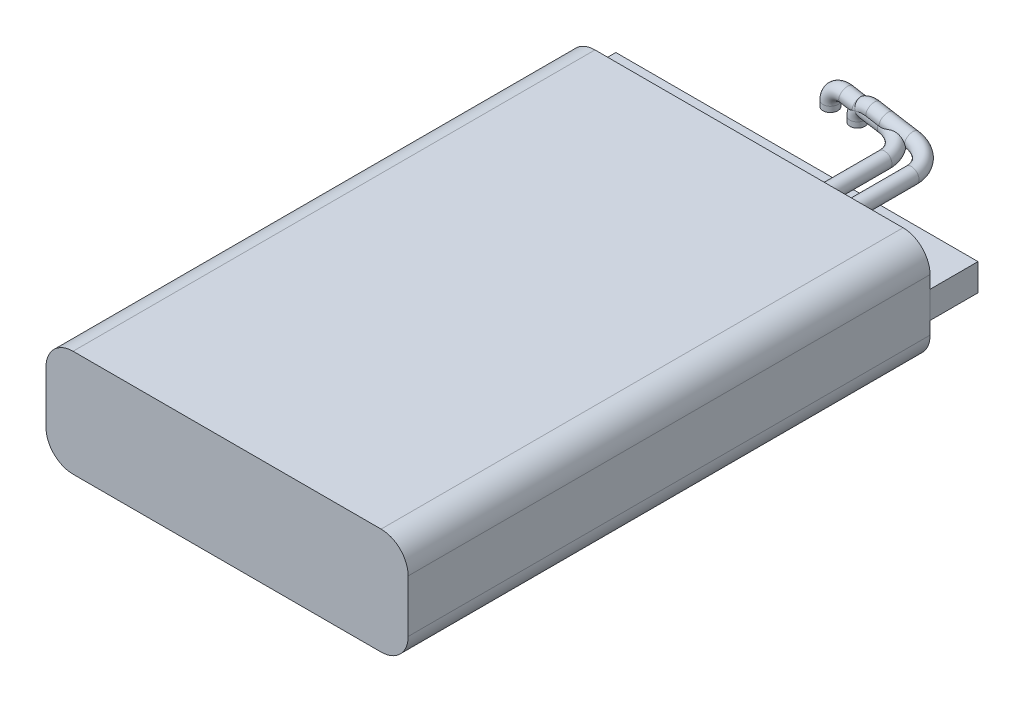
ISO-10303-21;
HEADER;
FILE_DESCRIPTION(('STEP AP214'),'2;1');
FILE_NAME('part.step','',(''),(''),'','','');
FILE_SCHEMA(('AUTOMOTIVE_DESIGN { 1 0 10303 214 1 1 1 1 }'));
ENDSEC;
DATA;
#1=APPLICATION_CONTEXT('core data for automotive mechanical design processes');
#2=APPLICATION_PROTOCOL_DEFINITION('international standard','automotive_design',2000,#1);
#3=PRODUCT_CONTEXT('',#1,'mechanical');
#4=PRODUCT('Part','Part','',(#3));
#5=PRODUCT_RELATED_PRODUCT_CATEGORY('part','',(#4));
#6=PRODUCT_DEFINITION_FORMATION('','',#4);
#7=PRODUCT_DEFINITION_CONTEXT('part definition',#1,'design');
#8=PRODUCT_DEFINITION('design','',#6,#7);
#9=PRODUCT_DEFINITION_SHAPE('','',#8);
#10=(LENGTH_UNIT() NAMED_UNIT(*) SI_UNIT(.MILLI.,.METRE.));
#11=(NAMED_UNIT(*) PLANE_ANGLE_UNIT() SI_UNIT($,.RADIAN.));
#12=(NAMED_UNIT(*) SI_UNIT($,.STERADIAN.) SOLID_ANGLE_UNIT());
#13=UNCERTAINTY_MEASURE_WITH_UNIT(LENGTH_MEASURE(1.E-05),#10,'distance_accuracy_value','');
#14=(GEOMETRIC_REPRESENTATION_CONTEXT(3) GLOBAL_UNCERTAINTY_ASSIGNED_CONTEXT((#13)) GLOBAL_UNIT_ASSIGNED_CONTEXT((#10,
#11,#12)) REPRESENTATION_CONTEXT('',''));
#15=CARTESIAN_POINT('',(0.,0.,0.));
#16=DIRECTION('',(0.,0.,1.));
#17=DIRECTION('',(1.,0.,0.));
#18=AXIS2_PLACEMENT_3D('',#15,#16,#17);
#19=CARTESIAN_POINT('',(0.,1.27,-34.682));
#20=DIRECTION('',(0.,-1.,0.));
#21=DIRECTION('',(0.151624715441043,0.,0.988438134466403));
#22=AXIS2_PLACEMENT_3D('',#19,#20,#21);
#23=PLANE('',#22);
#24=CARTESIAN_POINT('',(0.,1.27,-34.682));
#25=DIRECTION('',(0.,-1.,0.));
#26=DIRECTION('',(0.151624715441043,0.,0.988438134466403));
#27=AXIS2_PLACEMENT_3D('',#24,#25,#26);
#28=CIRCLE('',#27,0.6985);
#29=CARTESIAN_POINT('',(0.105909863735568,1.27,-33.9915759630752));
#30=VERTEX_POINT('',#29);
#31=EDGE_CURVE('E76',#30,#30,#28,.T.);
#32=ORIENTED_EDGE('',*,*,#31,.T.);
#33=EDGE_LOOP('',(#32));
#34=FACE_BOUND('',#33,.T.);
#35=ADVANCED_FACE('F64',(#34),#23,.T.);
#36=CARTESIAN_POINT('',(7.62,2.032,-24.522));
#37=DIRECTION('',(0.,0.,-1.));
#38=DIRECTION('',(-1.,0.,0.));
#39=AXIS2_PLACEMENT_3D('',#36,#37,#38);
#40=PLANE('',#39);
#41=CARTESIAN_POINT('',(7.62,2.032,-24.522));
#42=DIRECTION('',(0.,0.,-1.));
#43=DIRECTION('',(-1.,0.,0.));
#44=AXIS2_PLACEMENT_3D('',#41,#42,#43);
#45=CIRCLE('',#44,0.6985);
#46=CARTESIAN_POINT('',(6.9215,2.032,-24.522));
#47=VERTEX_POINT('',#46);
#48=EDGE_CURVE('E13',#47,#47,#45,.T.);
#49=ORIENTED_EDGE('',*,*,#48,.F.);
#50=EDGE_LOOP('',(#49));
#51=FACE_BOUND('',#50,.T.);
#52=ADVANCED_FACE('F82',(#51),#40,.F.);
#53=CARTESIAN_POINT('',(0.,1.27,-34.682));
#54=DIRECTION('',(0.,1.,0.));
#55=DIRECTION('',(0.,0.,1.));
#56=AXIS2_PLACEMENT_3D('',#53,#54,#55);
#57=CYLINDRICAL_SURFACE('',#56,0.6985);
#58=CARTESIAN_POINT('',(0.,1.778,-34.682));
#59=DIRECTION('',(0.,-1.,0.));
#60=DIRECTION('',(0.151624715441043,0.,0.988438134466403));
#61=AXIS2_PLACEMENT_3D('',#58,#59,#60);
#62=CIRCLE('',#61,0.6985);
#63=CARTESIAN_POINT('',(-0.698500000000001,1.778,-34.682));
#64=VERTEX_POINT('',#63);
#65=EDGE_CURVE('E120',#64,#64,#62,.T.);
#66=ORIENTED_EDGE('',*,*,#65,.T.);
#67=EDGE_LOOP('',(#66));
#68=FACE_BOUND('',#67,.T.);
#69=ORIENTED_EDGE('',*,*,#31,.F.);
#70=EDGE_LOOP('',(#69));
#71=FACE_BOUND('',#70,.T.);
#72=ADVANCED_FACE('F84',(#68,#71),#57,.T.);
#73=CARTESIAN_POINT('',(1.27,1.778,-34.682));
#74=DIRECTION('',(0.,0.,-1.));
#75=DIRECTION('',(-1.,0.,0.));
#76=AXIS2_PLACEMENT_3D('',#73,#74,#75);
#77=TOROIDAL_SURFACE('',#76,1.27,0.6985);
#78=CARTESIAN_POINT('',(1.49087097393539,3.02864623809966,-34.682));
#79=DIRECTION('',(-0.984760817401307,0.173914152705035,0.));
#80=DIRECTION('',(-0.0263696839150719,-0.149314078715963,0.988438134466403));
#81=AXIS2_PLACEMENT_3D('',#78,#79,#80);
#82=CIRCLE('',#81,0.6985);
#83=CARTESIAN_POINT('',(1.61235000959986,3.71650166905447,-34.682));
#84=VERTEX_POINT('',#83);
#85=EDGE_CURVE('E117',#84,#84,#82,.T.);
#86=CARTESIAN_POINT('',(1.27,1.778,-34.682));
#87=DIRECTION('',(0.,0.,-1.));
#88=DIRECTION('',(-1.,0.,0.));
#89=AXIS2_PLACEMENT_3D('',#86,#87,#88);
#90=CIRCLE('',#89,1.9685);
#91=EDGE_CURVE('',#64,#84,#90,.T.);
#92=ORIENTED_EDGE('',*,*,#65,.F.);
#93=ORIENTED_EDGE('',*,*,#85,.T.);
#94=ORIENTED_EDGE('',*,*,#91,.T.);
#95=ORIENTED_EDGE('',*,*,#91,.F.);
#96=EDGE_LOOP('',(#92,#94,#93,#95));
#97=FACE_BOUND('',#96,.T.);
#98=ADVANCED_FACE('F89',(#97),#77,.T.);
#99=CARTESIAN_POINT('',(1.4908709739354,3.02864623809966,-34.682));
#100=DIRECTION('',(0.984760817401307,-0.173914152705036,0.));
#101=DIRECTION('',(0.173914152705036,0.984760817401307,0.));
#102=AXIS2_PLACEMENT_3D('',#99,#100,#101);
#103=CYLINDRICAL_SURFACE('',#102,0.6985);
#104=CARTESIAN_POINT('',(2.74151721203505,2.80777526416426,-34.682));
#105=DIRECTION('',(-0.984760817401307,0.173914152705036,0.));
#106=DIRECTION('',(-0.0263696839150713,-0.149314078715963,0.988438134466403));
#107=AXIS2_PLACEMENT_3D('',#104,#105,#106);
#108=CIRCLE('',#107,0.6985);
#109=CARTESIAN_POINT('',(2.62003817637059,2.11991983320947,-34.682));
#110=VERTEX_POINT('',#109);
#111=EDGE_CURVE('E122',#110,#110,#108,.T.);
#112=ORIENTED_EDGE('',*,*,#111,.T.);
#113=EDGE_LOOP('',(#112));
#114=FACE_BOUND('',#113,.T.);
#115=ORIENTED_EDGE('',*,*,#85,.F.);
#116=EDGE_LOOP('',(#115));
#117=FACE_BOUND('',#116,.T.);
#118=ADVANCED_FACE('F105',(#114,#117),#103,.T.);
#119=CARTESIAN_POINT('',(21.2167532087433,107.420816921893,-34.682));
#120=DIRECTION('',(0.,0.,1.));
#121=DIRECTION('',(1.,0.,0.));
#122=AXIS2_PLACEMENT_3D('',#119,#120,#121);
#123=TOROIDAL_SURFACE('',#122,106.231929428095,0.6985);
#124=CARTESIAN_POINT('',(5.10936713845525,2.41712677722029,-34.682));
#125=DIRECTION('',(-0.988438134466402,0.151624715441045,0.));
#126=DIRECTION('',(-0.0229900543325776,-0.149871650869545,0.988438134466403));
#127=AXIS2_PLACEMENT_3D('',#124,#125,#126);
#128=CIRCLE('',#127,0.6985);
#129=CARTESIAN_POINT('',(5.00345727471969,1.72670274029552,-34.682));
#130=VERTEX_POINT('',#129);
#131=EDGE_CURVE('E128',#130,#130,#128,.T.);
#132=CARTESIAN_POINT('',(21.2167532087433,107.420816921893,-34.682));
#133=DIRECTION('',(0.,0.,1.));
#134=DIRECTION('',(1.,0.,0.));
#135=AXIS2_PLACEMENT_3D('',#132,#133,#134);
#136=CIRCLE('',#135,106.930429428095);
#137=EDGE_CURVE('',#110,#130,#136,.T.);
#138=ORIENTED_EDGE('',*,*,#111,.F.);
#139=ORIENTED_EDGE('',*,*,#131,.T.);
#140=ORIENTED_EDGE('',*,*,#137,.T.);
#141=ORIENTED_EDGE('',*,*,#137,.F.);
#142=EDGE_LOOP('',(#138,#140,#139,#141));
#143=FACE_BOUND('',#142,.T.);
#144=ADVANCED_FACE('F99',(#143),#123,.T.);
#145=CARTESIAN_POINT('',(5.10936713845534,2.41712677722025,-32.142));
#146=DIRECTION('',(-0.151624715441044,-0.988438134466403,0.));
#147=DIRECTION('',(0.988438134466403,-0.151624715441044,0.));
#148=AXIS2_PLACEMENT_3D('',#145,#146,#147);
#149=TOROIDAL_SURFACE('',#148,2.54,0.6985);
#150=CARTESIAN_POINT('',(7.62,2.032,-32.142));
#151=DIRECTION('',(0.,0.,-1.));
#152=DIRECTION('',(-1.,0.,0.));
#153=AXIS2_PLACEMENT_3D('',#150,#151,#152);
#154=CIRCLE('',#153,0.6985);
#155=CARTESIAN_POINT('',(6.9215,2.032,-32.142));
#156=VERTEX_POINT('',#155);
#157=EDGE_CURVE('E71',#156,#156,#154,.T.);
#158=ORIENTED_EDGE('',*,*,#157,.T.);
#159=EDGE_LOOP('',(#158));
#160=FACE_BOUND('',#159,.T.);
#161=ORIENTED_EDGE('',*,*,#131,.F.);
#162=EDGE_LOOP('',(#161));
#163=FACE_BOUND('',#162,.T.);
#164=ADVANCED_FACE('F95',(#160,#163),#149,.T.);
#165=CARTESIAN_POINT('',(7.62,2.032,-32.142));
#166=DIRECTION('',(0.,0.,1.));
#167=DIRECTION('',(1.,0.,0.));
#168=AXIS2_PLACEMENT_3D('',#165,#166,#167);
#169=CYLINDRICAL_SURFACE('',#168,0.6985);
#170=ORIENTED_EDGE('',*,*,#48,.T.);
#171=EDGE_LOOP('',(#170));
#172=FACE_BOUND('',#171,.T.);
#173=ORIENTED_EDGE('',*,*,#157,.F.);
#174=EDGE_LOOP('',(#173));
#175=FACE_BOUND('',#174,.T.);
#176=ADVANCED_FACE('F79',(#172,#175),#169,.T.);
#177=CLOSED_SHELL('',(#35,#52,#72,#98,#118,#144,#164,#176));
#178=MANIFOLD_SOLID_BREP('B2',#177);
#179=CARTESIAN_POINT('',(-2.54,1.27,-34.682));
#180=DIRECTION('',(0.,-1.,0.));
#181=DIRECTION('',(0.151624715441043,0.,0.988438134466403));
#182=AXIS2_PLACEMENT_3D('',#179,#180,#181);
#183=PLANE('',#182);
#184=CARTESIAN_POINT('',(-2.54,1.27,-34.682));
#185=DIRECTION('',(0.,-1.,0.));
#186=DIRECTION('',(0.151624715441043,0.,0.988438134466403));
#187=AXIS2_PLACEMENT_3D('',#184,#185,#186);
#188=CIRCLE('',#187,0.6985);
#189=CARTESIAN_POINT('',(-2.43409013626443,1.27,-33.9915759630752));
#190=VERTEX_POINT('',#189);
#191=EDGE_CURVE('E220',#190,#190,#188,.T.);
#192=ORIENTED_EDGE('',*,*,#191,.T.);
#193=EDGE_LOOP('',(#192));
#194=FACE_BOUND('',#193,.T.);
#195=ADVANCED_FACE('F208',(#194),#183,.T.);
#196=CARTESIAN_POINT('',(5.08,2.032,-24.522));
#197=DIRECTION('',(0.,0.,-1.));
#198=DIRECTION('',(-1.,0.,0.));
#199=AXIS2_PLACEMENT_3D('',#196,#197,#198);
#200=PLANE('',#199);
#201=CARTESIAN_POINT('',(5.08,2.032,-24.522));
#202=DIRECTION('',(0.,0.,-1.));
#203=DIRECTION('',(-1.,0.,0.));
#204=AXIS2_PLACEMENT_3D('',#201,#202,#203);
#205=CIRCLE('',#204,0.6985);
#206=CARTESIAN_POINT('',(4.3815,2.032,-24.522));
#207=VERTEX_POINT('',#206);
#208=EDGE_CURVE('E62',#207,#207,#205,.T.);
#209=ORIENTED_EDGE('',*,*,#208,.F.);
#210=EDGE_LOOP('',(#209));
#211=FACE_BOUND('',#210,.T.);
#212=ADVANCED_FACE('F226',(#211),#200,.F.);
#213=CARTESIAN_POINT('',(-2.54,1.27,-34.682));
#214=DIRECTION('',(0.,1.,0.));
#215=DIRECTION('',(0.,0.,1.));
#216=AXIS2_PLACEMENT_3D('',#213,#214,#215);
#217=CYLINDRICAL_SURFACE('',#216,0.6985);
#218=CARTESIAN_POINT('',(-2.54,1.778,-34.682));
#219=DIRECTION('',(0.,-1.,0.));
#220=DIRECTION('',(0.151624715441043,0.,0.988438134466403));
#221=AXIS2_PLACEMENT_3D('',#218,#219,#220);
#222=CIRCLE('',#221,0.6985);
#223=CARTESIAN_POINT('',(-3.2385,1.778,-34.682));
#224=VERTEX_POINT('',#223);
#225=EDGE_CURVE('E264',#224,#224,#222,.T.);
#226=ORIENTED_EDGE('',*,*,#225,.T.);
#227=EDGE_LOOP('',(#226));
#228=FACE_BOUND('',#227,.T.);
#229=ORIENTED_EDGE('',*,*,#191,.F.);
#230=EDGE_LOOP('',(#229));
#231=FACE_BOUND('',#230,.T.);
#232=ADVANCED_FACE('F228',(#228,#231),#217,.T.);
#233=CARTESIAN_POINT('',(-1.27,1.778,-34.682));
#234=DIRECTION('',(0.,0.,-1.));
#235=DIRECTION('',(-1.,0.,0.));
#236=AXIS2_PLACEMENT_3D('',#233,#234,#235);
#237=TOROIDAL_SURFACE('',#236,1.27,0.6985);
#238=CARTESIAN_POINT('',(-1.04912902606461,3.02864623809966,-34.682));
#239=DIRECTION('',(-0.984760817401307,0.173914152705035,0.));
#240=DIRECTION('',(-0.0263696839150719,-0.149314078715963,0.988438134466403));
#241=AXIS2_PLACEMENT_3D('',#238,#239,#240);
#242=CIRCLE('',#241,0.6985);
#243=CARTESIAN_POINT('',(-0.927649990400142,3.71650166905447,-34.682));
#244=VERTEX_POINT('',#243);
#245=EDGE_CURVE('E261',#244,#244,#242,.T.);
#246=CARTESIAN_POINT('',(-1.27,1.778,-34.682));
#247=DIRECTION('',(0.,0.,-1.));
#248=DIRECTION('',(-1.,0.,0.));
#249=AXIS2_PLACEMENT_3D('',#246,#247,#248);
#250=CIRCLE('',#249,1.9685);
#251=EDGE_CURVE('',#224,#244,#250,.T.);
#252=ORIENTED_EDGE('',*,*,#225,.F.);
#253=ORIENTED_EDGE('',*,*,#245,.T.);
#254=ORIENTED_EDGE('',*,*,#251,.T.);
#255=ORIENTED_EDGE('',*,*,#251,.F.);
#256=EDGE_LOOP('',(#252,#254,#253,#255));
#257=FACE_BOUND('',#256,.T.);
#258=ADVANCED_FACE('F233',(#257),#237,.T.);
#259=CARTESIAN_POINT('',(-1.0491290260646,3.02864623809966,-34.682));
#260=DIRECTION('',(0.984760817401307,-0.173914152705036,0.));
#261=DIRECTION('',(0.173914152705036,0.984760817401307,0.));
#262=AXIS2_PLACEMENT_3D('',#259,#260,#261);
#263=CYLINDRICAL_SURFACE('',#262,0.6985);
#264=CARTESIAN_POINT('',(0.201517212035054,2.80777526416426,-34.682));
#265=DIRECTION('',(-0.984760817401307,0.173914152705036,0.));
#266=DIRECTION('',(-0.0263696839150713,-0.149314078715963,0.988438134466403));
#267=AXIS2_PLACEMENT_3D('',#264,#265,#266);
#268=CIRCLE('',#267,0.6985);
#269=CARTESIAN_POINT('',(0.0800381763705893,2.11991983320947,-34.682));
#270=VERTEX_POINT('',#269);
#271=EDGE_CURVE('E266',#270,#270,#268,.T.);
#272=ORIENTED_EDGE('',*,*,#271,.T.);
#273=EDGE_LOOP('',(#272));
#274=FACE_BOUND('',#273,.T.);
#275=ORIENTED_EDGE('',*,*,#245,.F.);
#276=EDGE_LOOP('',(#275));
#277=FACE_BOUND('',#276,.T.);
#278=ADVANCED_FACE('F249',(#274,#277),#263,.T.);
#279=CARTESIAN_POINT('',(18.6767532087433,107.420816921893,-34.682));
#280=DIRECTION('',(0.,0.,1.));
#281=DIRECTION('',(1.,0.,0.));
#282=AXIS2_PLACEMENT_3D('',#279,#280,#281);
#283=TOROIDAL_SURFACE('',#282,106.231929428095,0.6985);
#284=CARTESIAN_POINT('',(2.56936713845525,2.41712677722029,-34.682));
#285=DIRECTION('',(-0.988438134466402,0.151624715441045,0.));
#286=DIRECTION('',(-0.0229900543325776,-0.149871650869545,0.988438134466403));
#287=AXIS2_PLACEMENT_3D('',#284,#285,#286);
#288=CIRCLE('',#287,0.6985);
#289=CARTESIAN_POINT('',(2.46345727471969,1.72670274029552,-34.682));
#290=VERTEX_POINT('',#289);
#291=EDGE_CURVE('E272',#290,#290,#288,.T.);
#292=CARTESIAN_POINT('',(18.6767532087433,107.420816921893,-34.682));
#293=DIRECTION('',(0.,0.,1.));
#294=DIRECTION('',(1.,0.,0.));
#295=AXIS2_PLACEMENT_3D('',#292,#293,#294);
#296=CIRCLE('',#295,106.930429428095);
#297=EDGE_CURVE('',#270,#290,#296,.T.);
#298=ORIENTED_EDGE('',*,*,#271,.F.);
#299=ORIENTED_EDGE('',*,*,#291,.T.);
#300=ORIENTED_EDGE('',*,*,#297,.T.);
#301=ORIENTED_EDGE('',*,*,#297,.F.);
#302=EDGE_LOOP('',(#298,#300,#299,#301));
#303=FACE_BOUND('',#302,.T.);
#304=ADVANCED_FACE('F243',(#303),#283,.T.);
#305=CARTESIAN_POINT('',(2.56936713845534,2.41712677722025,-32.142));
#306=DIRECTION('',(-0.151624715441044,-0.988438134466403,0.));
#307=DIRECTION('',(0.988438134466403,-0.151624715441044,0.));
#308=AXIS2_PLACEMENT_3D('',#305,#306,#307);
#309=TOROIDAL_SURFACE('',#308,2.54,0.6985);
#310=CARTESIAN_POINT('',(5.08,2.032,-32.142));
#311=DIRECTION('',(0.,0.,-1.));
#312=DIRECTION('',(-1.,0.,0.));
#313=AXIS2_PLACEMENT_3D('',#310,#311,#312);
#314=CIRCLE('',#313,0.6985);
#315=CARTESIAN_POINT('',(4.3815,2.032,-32.142));
#316=VERTEX_POINT('',#315);
#317=EDGE_CURVE('E215',#316,#316,#314,.T.);
#318=ORIENTED_EDGE('',*,*,#317,.T.);
#319=EDGE_LOOP('',(#318));
#320=FACE_BOUND('',#319,.T.);
#321=ORIENTED_EDGE('',*,*,#291,.F.);
#322=EDGE_LOOP('',(#321));
#323=FACE_BOUND('',#322,.T.);
#324=ADVANCED_FACE('F239',(#320,#323),#309,.T.);
#325=CARTESIAN_POINT('',(5.08,2.032,-32.142));
#326=DIRECTION('',(0.,0.,1.));
#327=DIRECTION('',(1.,0.,0.));
#328=AXIS2_PLACEMENT_3D('',#325,#326,#327);
#329=CYLINDRICAL_SURFACE('',#328,0.6985);
#330=ORIENTED_EDGE('',*,*,#208,.T.);
#331=EDGE_LOOP('',(#330));
#332=FACE_BOUND('',#331,.T.);
#333=ORIENTED_EDGE('',*,*,#317,.F.);
#334=EDGE_LOOP('',(#333));
#335=FACE_BOUND('',#334,.T.);
#336=ADVANCED_FACE('F223',(#332,#335),#329,.T.);
#337=CLOSED_SHELL('',(#195,#212,#232,#258,#278,#304,#324,#336));
#338=MANIFOLD_SOLID_BREP('B7',#337);
#339=CARTESIAN_POINT('',(-17.,1.27,9.59474446304005));
#340=DIRECTION('',(1.,0.,0.));
#341=DIRECTION('',(0.,0.,-1.));
#342=AXIS2_PLACEMENT_3D('',#339,#340,#341);
#343=PLANE('',#342);
#344=DIRECTION('',(0.,-1.,0.));
#345=VECTOR('',#344,1.);
#346=CARTESIAN_POINT('',(-17.,1.27,-24.5));
#347=LINE('',#346,#345);
#348=CARTESIAN_POINT('',(-17.,1.27,-24.5));
#349=VERTEX_POINT('',#348);
#350=CARTESIAN_POINT('',(-17.,-1.27,-24.5));
#351=VERTEX_POINT('',#350);
#352=EDGE_CURVE('E401',#349,#351,#347,.T.);
#353=ORIENTED_EDGE('',*,*,#352,.F.);
#354=DIRECTION('',(0.,0.,-1.));
#355=VECTOR('',#354,1.);
#356=CARTESIAN_POINT('',(-17.,1.27,9.59474446304005));
#357=LINE('',#356,#355);
#358=CARTESIAN_POINT('',(-17.,1.27,-29.));
#359=VERTEX_POINT('',#358);
#360=EDGE_CURVE('E355',#349,#359,#357,.T.);
#361=ORIENTED_EDGE('',*,*,#360,.T.);
#362=DIRECTION('',(0.,-1.,0.));
#363=VECTOR('',#362,1.);
#364=CARTESIAN_POINT('',(-17.,1.27,-29.));
#365=LINE('',#364,#363);
#366=CARTESIAN_POINT('',(-17.,-1.27,-29.));
#367=VERTEX_POINT('',#366);
#368=EDGE_CURVE('E399',#359,#367,#365,.T.);
#369=ORIENTED_EDGE('',*,*,#368,.T.);
#370=DIRECTION('',(0.,0.,-1.));
#371=VECTOR('',#370,1.);
#372=CARTESIAN_POINT('',(-17.,-1.27,9.59474446304005));
#373=LINE('',#372,#371);
#374=EDGE_CURVE('E390',#351,#367,#373,.T.);
#375=ORIENTED_EDGE('',*,*,#374,.F.);
#376=EDGE_LOOP('',(#353,#361,#369,#375));
#377=FACE_BOUND('',#376,.T.);
#378=ADVANCED_FACE('F351',(#377),#343,.F.);
#379=CARTESIAN_POINT('',(-17.,-1.27,9.59474446304005));
#380=DIRECTION('',(0.,1.,0.));
#381=DIRECTION('',(0.,0.,1.));
#382=AXIS2_PLACEMENT_3D('',#379,#380,#381);
#383=PLANE('',#382);
#384=DIRECTION('',(1.,0.,0.));
#385=VECTOR('',#384,1.);
#386=CARTESIAN_POINT('',(-17.,-1.27,-24.5));
#387=LINE('',#386,#385);
#388=CARTESIAN_POINT('',(17.,-1.27,-24.5));
#389=VERTEX_POINT('',#388);
#390=EDGE_CURVE('E360',#351,#389,#387,.T.);
#391=ORIENTED_EDGE('',*,*,#390,.F.);
#392=ORIENTED_EDGE('',*,*,#374,.T.);
#393=DIRECTION('',(1.,0.,0.));
#394=VECTOR('',#393,1.);
#395=CARTESIAN_POINT('',(-17.,-1.27,-29.));
#396=LINE('',#395,#394);
#397=CARTESIAN_POINT('',(17.,-1.27,-29.));
#398=VERTEX_POINT('',#397);
#399=EDGE_CURVE('E411',#367,#398,#396,.T.);
#400=ORIENTED_EDGE('',*,*,#399,.T.);
#401=DIRECTION('',(0.,0.,-1.));
#402=VECTOR('',#401,1.);
#403=CARTESIAN_POINT('',(17.,-1.27,9.59474446304005));
#404=LINE('',#403,#402);
#405=EDGE_CURVE('E420',#389,#398,#404,.T.);
#406=ORIENTED_EDGE('',*,*,#405,.F.);
#407=EDGE_LOOP('',(#391,#392,#400,#406));
#408=FACE_BOUND('',#407,.T.);
#409=ADVANCED_FACE('F424',(#408),#383,.F.);
#410=CARTESIAN_POINT('',(17.,1.27,9.59474446304005));
#411=DIRECTION('',(-1.,0.,0.));
#412=DIRECTION('',(0.,0.,1.));
#413=AXIS2_PLACEMENT_3D('',#410,#411,#412);
#414=PLANE('',#413);
#415=DIRECTION('',(0.,1.,0.));
#416=VECTOR('',#415,1.);
#417=CARTESIAN_POINT('',(17.,1.27,-24.5));
#418=LINE('',#417,#416);
#419=CARTESIAN_POINT('',(17.,1.27,-24.5));
#420=VERTEX_POINT('',#419);
#421=EDGE_CURVE('E206',#389,#420,#418,.T.);
#422=ORIENTED_EDGE('',*,*,#421,.F.);
#423=ORIENTED_EDGE('',*,*,#405,.T.);
#424=DIRECTION('',(0.,1.,0.));
#425=VECTOR('',#424,1.);
#426=CARTESIAN_POINT('',(17.,1.27,-29.));
#427=LINE('',#426,#425);
#428=CARTESIAN_POINT('',(17.,1.27,-29.));
#429=VERTEX_POINT('',#428);
#430=EDGE_CURVE('E421',#398,#429,#427,.T.);
#431=ORIENTED_EDGE('',*,*,#430,.T.);
#432=DIRECTION('',(0.,0.,-1.));
#433=VECTOR('',#432,1.);
#434=CARTESIAN_POINT('',(17.,1.27,9.59474446304005));
#435=LINE('',#434,#433);
#436=EDGE_CURVE('E373',#420,#429,#435,.T.);
#437=ORIENTED_EDGE('',*,*,#436,.F.);
#438=EDGE_LOOP('',(#422,#423,#431,#437));
#439=FACE_BOUND('',#438,.T.);
#440=ADVANCED_FACE('F423',(#439),#414,.F.);
#441=CARTESIAN_POINT('',(-17.,1.27,9.59474446304005));
#442=DIRECTION('',(0.,-1.,0.));
#443=DIRECTION('',(0.,0.,-1.));
#444=AXIS2_PLACEMENT_3D('',#441,#442,#443);
#445=PLANE('',#444);
#446=DIRECTION('',(-1.,0.,0.));
#447=VECTOR('',#446,1.);
#448=CARTESIAN_POINT('',(-17.,1.27,-24.5));
#449=LINE('',#448,#447);
#450=EDGE_CURVE('E408',#420,#349,#449,.T.);
#451=ORIENTED_EDGE('',*,*,#450,.F.);
#452=ORIENTED_EDGE('',*,*,#436,.T.);
#453=DIRECTION('',(-1.,0.,0.));
#454=VECTOR('',#453,1.);
#455=CARTESIAN_POINT('',(-17.,1.27,-29.));
#456=LINE('',#455,#454);
#457=EDGE_CURVE('E404',#429,#359,#456,.T.);
#458=ORIENTED_EDGE('',*,*,#457,.T.);
#459=ORIENTED_EDGE('',*,*,#360,.F.);
#460=EDGE_LOOP('',(#451,#452,#458,#459));
#461=FACE_BOUND('',#460,.T.);
#462=ADVANCED_FACE('F405',(#461),#445,.F.);
#463=CARTESIAN_POINT('',(0.,0.,-29.));
#464=DIRECTION('',(0.,0.,1.));
#465=DIRECTION('',(1.,0.,0.));
#466=AXIS2_PLACEMENT_3D('',#463,#464,#465);
#467=PLANE('',#466);
#468=ORIENTED_EDGE('',*,*,#368,.F.);
#469=ORIENTED_EDGE('',*,*,#457,.F.);
#470=ORIENTED_EDGE('',*,*,#430,.F.);
#471=ORIENTED_EDGE('',*,*,#399,.F.);
#472=EDGE_LOOP('',(#468,#469,#470,#471));
#473=FACE_BOUND('',#472,.T.);
#474=ADVANCED_FACE('F410',(#473),#467,.F.);
#475=CARTESIAN_POINT('',(-17.,5.,-24.5));
#476=DIRECTION('',(0.,0.,1.));
#477=DIRECTION('',(1.,0.,0.));
#478=AXIS2_PLACEMENT_3D('',#475,#476,#477);
#479=PLANE('',#478);
#480=ORIENTED_EDGE('',*,*,#450,.T.);
#481=ORIENTED_EDGE('',*,*,#352,.T.);
#482=ORIENTED_EDGE('',*,*,#390,.T.);
#483=ORIENTED_EDGE('',*,*,#421,.T.);
#484=EDGE_LOOP('',(#480,#481,#482,#483));
#485=FACE_BOUND('',#484,.T.);
#486=ADVANCED_FACE('F353',(#485),#479,.T.);
#487=CLOSED_SHELL('',(#378,#409,#440,#462,#474,#486));
#488=MANIFOLD_SOLID_BREP('B56',#487);
#489=CARTESIAN_POINT('',(-17.,5.,-24.5));
#490=DIRECTION('',(1.,0.,0.));
#491=DIRECTION('',(0.,0.,-1.));
#492=AXIS2_PLACEMENT_3D('',#489,#490,#491);
#493=PLANE('',#492);
#494=DIRECTION('',(0.,-1.,0.));
#495=VECTOR('',#494,1.);
#496=CARTESIAN_POINT('',(-17.,5.,-24.5));
#497=LINE('',#496,#495);
#498=CARTESIAN_POINT('',(-17.,2.46,-24.5));
#499=VERTEX_POINT('',#498);
#500=CARTESIAN_POINT('',(-17.,-2.46,-24.5));
#501=VERTEX_POINT('',#500);
#502=EDGE_CURVE('E616',#499,#501,#497,.T.);
#503=ORIENTED_EDGE('',*,*,#502,.T.);
#504=DIRECTION('',(0.,0.,1.));
#505=VECTOR('',#504,1.);
#506=CARTESIAN_POINT('',(-17.,-2.46,-24.5));
#507=LINE('',#506,#505);
#508=CARTESIAN_POINT('',(-17.,-2.46,24.5));
#509=VERTEX_POINT('',#508);
#510=EDGE_CURVE('E572',#501,#509,#507,.T.);
#511=ORIENTED_EDGE('',*,*,#510,.T.);
#512=DIRECTION('',(0.,-1.,0.));
#513=VECTOR('',#512,1.);
#514=CARTESIAN_POINT('',(-17.,5.,24.5));
#515=LINE('',#514,#513);
#516=CARTESIAN_POINT('',(-17.,2.46,24.5));
#517=VERTEX_POINT('',#516);
#518=EDGE_CURVE('E556',#517,#509,#515,.T.);
#519=ORIENTED_EDGE('',*,*,#518,.F.);
#520=DIRECTION('',(0.,0.,1.));
#521=VECTOR('',#520,1.);
#522=CARTESIAN_POINT('',(-17.,2.46,-24.5));
#523=LINE('',#522,#521);
#524=EDGE_CURVE('E569',#517,#499,#523,.F.);
#525=ORIENTED_EDGE('',*,*,#524,.T.);
#526=EDGE_LOOP('',(#503,#511,#519,#525));
#527=FACE_BOUND('',#526,.T.);
#528=ADVANCED_FACE('F487',(#527),#493,.F.);
#529=CARTESIAN_POINT('',(-17.,5.,24.5));
#530=DIRECTION('',(0.,0.,-1.));
#531=DIRECTION('',(-1.,0.,0.));
#532=AXIS2_PLACEMENT_3D('',#529,#530,#531);
#533=PLANE('',#532);
#534=ORIENTED_EDGE('',*,*,#518,.T.);
#535=CARTESIAN_POINT('',(-14.46,-2.46,24.5));
#536=DIRECTION('',(0.,0.,-1.));
#537=DIRECTION('',(-1.,0.,0.));
#538=AXIS2_PLACEMENT_3D('',#535,#536,#537);
#539=CIRCLE('',#538,2.54);
#540=CARTESIAN_POINT('',(-14.46,-5.,24.5));
#541=VERTEX_POINT('',#540);
#542=EDGE_CURVE('E563',#509,#541,#539,.F.);
#543=ORIENTED_EDGE('',*,*,#542,.T.);
#544=DIRECTION('',(1.,0.,0.));
#545=VECTOR('',#544,1.);
#546=CARTESIAN_POINT('',(-17.,-5.,24.5));
#547=LINE('',#546,#545);
#548=CARTESIAN_POINT('',(14.46,-5.,24.5));
#549=VERTEX_POINT('',#548);
#550=EDGE_CURVE('E622',#541,#549,#547,.T.);
#551=ORIENTED_EDGE('',*,*,#550,.T.);
#552=CARTESIAN_POINT('',(14.46,-2.46,24.5));
#553=DIRECTION('',(0.,0.,-1.));
#554=DIRECTION('',(-1.,0.,0.));
#555=AXIS2_PLACEMENT_3D('',#552,#553,#554);
#556=CIRCLE('',#555,2.54);
#557=CARTESIAN_POINT('',(17.,-2.46,24.5));
#558=VERTEX_POINT('',#557);
#559=EDGE_CURVE('E564',#549,#558,#556,.F.);
#560=ORIENTED_EDGE('',*,*,#559,.T.);
#561=DIRECTION('',(0.,-1.,0.));
#562=VECTOR('',#561,1.);
#563=CARTESIAN_POINT('',(17.,5.,24.5));
#564=LINE('',#563,#562);
#565=CARTESIAN_POINT('',(17.,2.46,24.5));
#566=VERTEX_POINT('',#565);
#567=EDGE_CURVE('E573',#566,#558,#564,.T.);
#568=ORIENTED_EDGE('',*,*,#567,.F.);
#569=CARTESIAN_POINT('',(14.46,2.46,24.5));
#570=DIRECTION('',(0.,0.,-1.));
#571=DIRECTION('',(-1.,0.,0.));
#572=AXIS2_PLACEMENT_3D('',#569,#570,#571);
#573=CIRCLE('',#572,2.54);
#574=CARTESIAN_POINT('',(14.46,5.,24.5));
#575=VERTEX_POINT('',#574);
#576=EDGE_CURVE('E579',#566,#575,#573,.F.);
#577=ORIENTED_EDGE('',*,*,#576,.T.);
#578=DIRECTION('',(1.,0.,0.));
#579=VECTOR('',#578,1.);
#580=CARTESIAN_POINT('',(-17.,5.,24.5));
#581=LINE('',#580,#579);
#582=CARTESIAN_POINT('',(-14.46,5.,24.5));
#583=VERTEX_POINT('',#582);
#584=EDGE_CURVE('E558',#583,#575,#581,.T.);
#585=ORIENTED_EDGE('',*,*,#584,.F.);
#586=CARTESIAN_POINT('',(-14.46,2.46,24.5));
#587=DIRECTION('',(0.,0.,-1.));
#588=DIRECTION('',(-1.,0.,0.));
#589=AXIS2_PLACEMENT_3D('',#586,#587,#588);
#590=CIRCLE('',#589,2.54);
#591=EDGE_CURVE('E553',#583,#517,#590,.F.);
#592=ORIENTED_EDGE('',*,*,#591,.T.);
#593=EDGE_LOOP('',(#534,#543,#551,#560,#568,#577,#585,#592));
#594=FACE_BOUND('',#593,.T.);
#595=ADVANCED_FACE('F555',(#594),#533,.F.);
#596=CARTESIAN_POINT('',(17.,5.,-24.5));
#597=DIRECTION('',(-1.,0.,0.));
#598=DIRECTION('',(0.,0.,1.));
#599=AXIS2_PLACEMENT_3D('',#596,#597,#598);
#600=PLANE('',#599);
#601=ORIENTED_EDGE('',*,*,#567,.T.);
#602=DIRECTION('',(0.,0.,-1.));
#603=VECTOR('',#602,1.);
#604=CARTESIAN_POINT('',(17.,-2.46,-24.5));
#605=LINE('',#604,#603);
#606=CARTESIAN_POINT('',(17.,-2.46,-24.5));
#607=VERTEX_POINT('',#606);
#608=EDGE_CURVE('E349',#558,#607,#605,.T.);
#609=ORIENTED_EDGE('',*,*,#608,.T.);
#610=DIRECTION('',(0.,-1.,0.));
#611=VECTOR('',#610,1.);
#612=CARTESIAN_POINT('',(17.,5.,-24.5));
#613=LINE('',#612,#611);
#614=CARTESIAN_POINT('',(17.,2.46,-24.5));
#615=VERTEX_POINT('',#614);
#616=EDGE_CURVE('E604',#615,#607,#613,.T.);
#617=ORIENTED_EDGE('',*,*,#616,.F.);
#618=DIRECTION('',(0.,0.,-1.));
#619=VECTOR('',#618,1.);
#620=CARTESIAN_POINT('',(17.,2.46,24.5));
#621=LINE('',#620,#619);
#622=EDGE_CURVE('E495',#615,#566,#621,.F.);
#623=ORIENTED_EDGE('',*,*,#622,.T.);
#624=EDGE_LOOP('',(#601,#609,#617,#623));
#625=FACE_BOUND('',#624,.T.);
#626=ADVANCED_FACE('F603',(#625),#600,.F.);
#627=CARTESIAN_POINT('',(-17.,5.,-24.5));
#628=DIRECTION('',(0.,0.,1.));
#629=DIRECTION('',(1.,0.,0.));
#630=AXIS2_PLACEMENT_3D('',#627,#628,#629);
#631=PLANE('',#630);
#632=DIRECTION('',(-1.,0.,0.));
#633=VECTOR('',#632,1.);
#634=CARTESIAN_POINT('',(-17.,-5.,-24.5));
#635=LINE('',#634,#633);
#636=CARTESIAN_POINT('',(14.46,-5.,-24.5));
#637=VERTEX_POINT('',#636);
#638=CARTESIAN_POINT('',(-14.46,-5.,-24.5));
#639=VERTEX_POINT('',#638);
#640=EDGE_CURVE('E619',#637,#639,#635,.T.);
#641=ORIENTED_EDGE('',*,*,#640,.T.);
#642=CARTESIAN_POINT('',(-14.46,-2.46,-24.5));
#643=DIRECTION('',(0.,0.,1.));
#644=DIRECTION('',(1.,0.,0.));
#645=AXIS2_PLACEMENT_3D('',#642,#643,#644);
#646=CIRCLE('',#645,2.54);
#647=EDGE_CURVE('E593',#639,#501,#646,.F.);
#648=ORIENTED_EDGE('',*,*,#647,.T.);
#649=ORIENTED_EDGE('',*,*,#502,.F.);
#650=CARTESIAN_POINT('',(-14.46,2.46,-24.5));
#651=DIRECTION('',(0.,0.,1.));
#652=DIRECTION('',(1.,0.,0.));
#653=AXIS2_PLACEMENT_3D('',#650,#651,#652);
#654=CIRCLE('',#653,2.54);
#655=CARTESIAN_POINT('',(-14.46,5.,-24.5));
#656=VERTEX_POINT('',#655);
#657=EDGE_CURVE('E577',#499,#656,#654,.F.);
#658=ORIENTED_EDGE('',*,*,#657,.T.);
#659=DIRECTION('',(-1.,0.,0.));
#660=VECTOR('',#659,1.);
#661=CARTESIAN_POINT('',(-17.,5.,-24.5));
#662=LINE('',#661,#660);
#663=CARTESIAN_POINT('',(14.46,5.,-24.5));
#664=VERTEX_POINT('',#663);
#665=EDGE_CURVE('E613',#664,#656,#662,.T.);
#666=ORIENTED_EDGE('',*,*,#665,.F.);
#667=CARTESIAN_POINT('',(14.46,2.46,-24.5));
#668=DIRECTION('',(0.,0.,1.));
#669=DIRECTION('',(1.,0.,0.));
#670=AXIS2_PLACEMENT_3D('',#667,#668,#669);
#671=CIRCLE('',#670,2.54);
#672=EDGE_CURVE('E509',#664,#615,#671,.F.);
#673=ORIENTED_EDGE('',*,*,#672,.T.);
#674=ORIENTED_EDGE('',*,*,#616,.T.);
#675=CARTESIAN_POINT('',(14.46,-2.46,-24.5));
#676=DIRECTION('',(0.,0.,1.));
#677=DIRECTION('',(1.,0.,0.));
#678=AXIS2_PLACEMENT_3D('',#675,#676,#677);
#679=CIRCLE('',#678,2.54);
#680=EDGE_CURVE('E502',#607,#637,#679,.F.);
#681=ORIENTED_EDGE('',*,*,#680,.T.);
#682=EDGE_LOOP('',(#641,#648,#649,#658,#666,#673,#674,#681));
#683=FACE_BOUND('',#682,.T.);
#684=ADVANCED_FACE('F615',(#683),#631,.F.);
#685=CARTESIAN_POINT('',(0.,5.,0.));
#686=DIRECTION('',(0.,1.,0.));
#687=DIRECTION('',(0.,0.,1.));
#688=AXIS2_PLACEMENT_3D('',#685,#686,#687);
#689=PLANE('',#688);
#690=ORIENTED_EDGE('',*,*,#665,.T.);
#691=DIRECTION('',(0.,0.,1.));
#692=VECTOR('',#691,1.);
#693=CARTESIAN_POINT('',(-14.46,5.,24.5));
#694=LINE('',#693,#692);
#695=EDGE_CURVE('E598',#656,#583,#694,.T.);
#696=ORIENTED_EDGE('',*,*,#695,.T.);
#697=ORIENTED_EDGE('',*,*,#584,.T.);
#698=DIRECTION('',(0.,0.,-1.));
#699=VECTOR('',#698,1.);
#700=CARTESIAN_POINT('',(14.46,5.,-24.5));
#701=LINE('',#700,#699);
#702=EDGE_CURVE('E595',#575,#664,#701,.T.);
#703=ORIENTED_EDGE('',*,*,#702,.T.);
#704=EDGE_LOOP('',(#690,#696,#697,#703));
#705=FACE_BOUND('',#704,.T.);
#706=ADVANCED_FACE('F612',(#705),#689,.T.);
#707=CARTESIAN_POINT('',(0.,-5.,0.));
#708=DIRECTION('',(0.,1.,0.));
#709=DIRECTION('',(0.,0.,1.));
#710=AXIS2_PLACEMENT_3D('',#707,#708,#709);
#711=PLANE('',#710);
#712=ORIENTED_EDGE('',*,*,#550,.F.);
#713=DIRECTION('',(0.,0.,1.));
#714=VECTOR('',#713,1.);
#715=CARTESIAN_POINT('',(-14.46,-5.,0.));
#716=LINE('',#715,#714);
#717=EDGE_CURVE('E588',#541,#639,#716,.F.);
#718=ORIENTED_EDGE('',*,*,#717,.T.);
#719=ORIENTED_EDGE('',*,*,#640,.F.);
#720=DIRECTION('',(0.,0.,-1.));
#721=VECTOR('',#720,1.);
#722=CARTESIAN_POINT('',(14.46,-5.,0.));
#723=LINE('',#722,#721);
#724=EDGE_CURVE('E586',#637,#549,#723,.F.);
#725=ORIENTED_EDGE('',*,*,#724,.T.);
#726=EDGE_LOOP('',(#712,#718,#719,#725));
#727=FACE_BOUND('',#726,.T.);
#728=ADVANCED_FACE('F629',(#727),#711,.F.);
#729=CARTESIAN_POINT('',(-14.46,-2.46,-24.5));
#730=DIRECTION('',(0.,0.,1.));
#731=DIRECTION('',(1.,0.,0.));
#732=AXIS2_PLACEMENT_3D('',#729,#730,#731);
#733=CYLINDRICAL_SURFACE('',#732,2.54);
#734=ORIENTED_EDGE('',*,*,#647,.F.);
#735=ORIENTED_EDGE('',*,*,#717,.F.);
#736=ORIENTED_EDGE('',*,*,#542,.F.);
#737=ORIENTED_EDGE('',*,*,#510,.F.);
#738=EDGE_LOOP('',(#734,#735,#736,#737));
#739=FACE_BOUND('',#738,.T.);
#740=ADVANCED_FACE('F637',(#739),#733,.T.);
#741=CARTESIAN_POINT('',(-14.46,2.46,0.));
#742=DIRECTION('',(0.,0.,-1.));
#743=DIRECTION('',(-1.,0.,0.));
#744=AXIS2_PLACEMENT_3D('',#741,#742,#743);
#745=CYLINDRICAL_SURFACE('',#744,2.54);
#746=ORIENTED_EDGE('',*,*,#657,.F.);
#747=ORIENTED_EDGE('',*,*,#524,.F.);
#748=ORIENTED_EDGE('',*,*,#591,.F.);
#749=ORIENTED_EDGE('',*,*,#695,.F.);
#750=EDGE_LOOP('',(#746,#747,#748,#749));
#751=FACE_BOUND('',#750,.T.);
#752=ADVANCED_FACE('F576',(#751),#745,.T.);
#753=CARTESIAN_POINT('',(14.46,-2.46,-24.5));
#754=DIRECTION('',(0.,0.,-1.));
#755=DIRECTION('',(-1.,0.,0.));
#756=AXIS2_PLACEMENT_3D('',#753,#754,#755);
#757=CYLINDRICAL_SURFACE('',#756,2.54);
#758=ORIENTED_EDGE('',*,*,#559,.F.);
#759=ORIENTED_EDGE('',*,*,#724,.F.);
#760=ORIENTED_EDGE('',*,*,#680,.F.);
#761=ORIENTED_EDGE('',*,*,#608,.F.);
#762=EDGE_LOOP('',(#758,#759,#760,#761));
#763=FACE_BOUND('',#762,.T.);
#764=ADVANCED_FACE('F631',(#763),#757,.T.);
#765=CARTESIAN_POINT('',(14.46,2.46,0.));
#766=DIRECTION('',(0.,0.,1.));
#767=DIRECTION('',(1.,0.,0.));
#768=AXIS2_PLACEMENT_3D('',#765,#766,#767);
#769=CYLINDRICAL_SURFACE('',#768,2.54);
#770=ORIENTED_EDGE('',*,*,#576,.F.);
#771=ORIENTED_EDGE('',*,*,#622,.F.);
#772=ORIENTED_EDGE('',*,*,#672,.F.);
#773=ORIENTED_EDGE('',*,*,#702,.F.);
#774=EDGE_LOOP('',(#770,#771,#772,#773));
#775=FACE_BOUND('',#774,.T.);
#776=ADVANCED_FACE('F489',(#775),#769,.T.);
#777=CLOSED_SHELL('',(#528,#595,#626,#684,#706,#728,#740,#752,#764,#776));
#778=MANIFOLD_SOLID_BREP('B200',#777);
#779=ADVANCED_BREP_SHAPE_REPRESENTATION('',(#18,#178,#338,#488,#778),#14);
#780=SHAPE_DEFINITION_REPRESENTATION(#9,#779);
ENDSEC;
END-ISO-10303-21;
